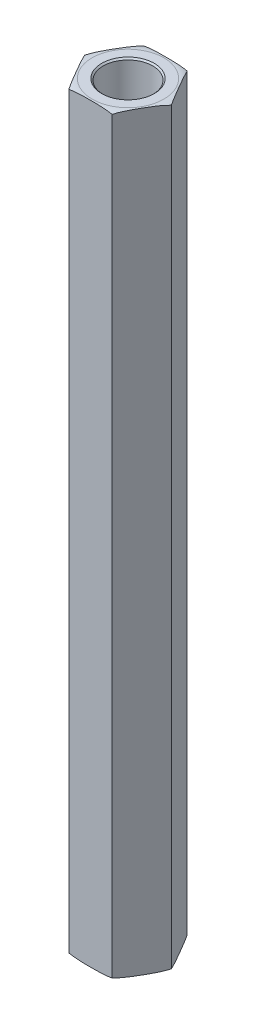
ISO-10303-21;
HEADER;
FILE_DESCRIPTION(('STEP AP214'),'2;1');
FILE_NAME('part.step','',(''),(''),'','','');
FILE_SCHEMA(('AUTOMOTIVE_DESIGN { 1 0 10303 214 1 1 1 1 }'));
ENDSEC;
DATA;
#1=APPLICATION_CONTEXT('core data for automotive mechanical design processes');
#2=APPLICATION_PROTOCOL_DEFINITION('international standard','automotive_design',2000,#1);
#3=PRODUCT_CONTEXT('',#1,'mechanical');
#4=PRODUCT('Part','Part','',(#3));
#5=PRODUCT_RELATED_PRODUCT_CATEGORY('part','',(#4));
#6=PRODUCT_DEFINITION_FORMATION('','',#4);
#7=PRODUCT_DEFINITION_CONTEXT('part definition',#1,'design');
#8=PRODUCT_DEFINITION('design','',#6,#7);
#9=PRODUCT_DEFINITION_SHAPE('','',#8);
#10=(LENGTH_UNIT() NAMED_UNIT(*) SI_UNIT(.MILLI.,.METRE.));
#11=(NAMED_UNIT(*) PLANE_ANGLE_UNIT() SI_UNIT($,.RADIAN.));
#12=(NAMED_UNIT(*) SI_UNIT($,.STERADIAN.) SOLID_ANGLE_UNIT());
#13=UNCERTAINTY_MEASURE_WITH_UNIT(LENGTH_MEASURE(1.E-05),#10,'distance_accuracy_value','');
#14=(GEOMETRIC_REPRESENTATION_CONTEXT(3) GLOBAL_UNCERTAINTY_ASSIGNED_CONTEXT((#13)) GLOBAL_UNIT_ASSIGNED_CONTEXT((#10,
#11,#12)) REPRESENTATION_CONTEXT('',''));
#15=CARTESIAN_POINT('',(0.,0.,0.));
#16=DIRECTION('',(0.,0.,1.));
#17=DIRECTION('',(1.,0.,0.));
#18=AXIS2_PLACEMENT_3D('',#15,#16,#17);
#19=CARTESIAN_POINT('',(0.,19.05,0.));
#20=DIRECTION('',(0.,1.,0.));
#21=DIRECTION('',(0.,0.,1.));
#22=AXIS2_PLACEMENT_3D('',#19,#20,#21);
#23=PLANE('',#22);
#24=CARTESIAN_POINT('',(0.,19.05,0.));
#25=DIRECTION('',(0.,1.,0.));
#26=DIRECTION('',(0.,0.,1.));
#27=AXIS2_PLACEMENT_3D('',#24,#25,#26);
#28=CIRCLE('',#27,2.0955);
#29=CARTESIAN_POINT('',(0.,19.05,2.0955));
#30=VERTEX_POINT('',#29);
#31=EDGE_CURVE('E302',#30,#30,#28,.T.);
#32=ORIENTED_EDGE('',*,*,#31,.T.);
#33=EDGE_LOOP('',(#32));
#34=FACE_BOUND('',#33,.T.);
#35=ADVANCED_FACE('F16',(#34),#23,.T.);
#36=CARTESIAN_POINT('',(0.,-19.05,0.));
#37=DIRECTION('',(0.,-1.,0.));
#38=DIRECTION('',(0.,0.,-1.));
#39=AXIS2_PLACEMENT_3D('',#36,#37,#38);
#40=PLANE('',#39);
#41=CARTESIAN_POINT('',(0.,-19.05,0.));
#42=DIRECTION('',(0.,-1.,0.));
#43=DIRECTION('',(0.,0.,-1.));
#44=AXIS2_PLACEMENT_3D('',#41,#42,#43);
#45=CIRCLE('',#44,2.0955);
#46=CARTESIAN_POINT('',(0.,-19.05,-2.0955));
#47=VERTEX_POINT('',#46);
#48=EDGE_CURVE('E312',#47,#47,#45,.T.);
#49=ORIENTED_EDGE('',*,*,#48,.T.);
#50=EDGE_LOOP('',(#49));
#51=FACE_BOUND('',#50,.T.);
#52=ADVANCED_FACE('F407',(#51),#40,.T.);
#53=CARTESIAN_POINT('',(0.,19.05,0.));
#54=DIRECTION('',(0.,1.,0.));
#55=DIRECTION('',(0.,0.,1.));
#56=AXIS2_PLACEMENT_3D('',#53,#54,#55);
#57=CYLINDRICAL_SURFACE('',#56,2.0955);
#58=CARTESIAN_POINT('',(0.,31.6230000000246,0.));
#59=DIRECTION('',(0.,1.,0.));
#60=DIRECTION('',(0.,0.,1.));
#61=AXIS2_PLACEMENT_3D('',#58,#59,#60);
#62=CIRCLE('',#61,2.09549999993897);
#63=CARTESIAN_POINT('',(0.,31.6230000000246,2.09549999993897));
#64=VERTEX_POINT('',#63);
#65=EDGE_CURVE('E314',#64,#64,#62,.T.);
#66=ORIENTED_EDGE('',*,*,#65,.T.);
#67=EDGE_LOOP('',(#66));
#68=FACE_BOUND('',#67,.T.);
#69=ORIENTED_EDGE('',*,*,#31,.F.);
#70=EDGE_LOOP('',(#69));
#71=FACE_BOUND('',#70,.T.);
#72=ADVANCED_FACE('F324',(#68,#71),#57,.F.);
#73=CARTESIAN_POINT('',(0.,-19.05,0.));
#74=DIRECTION('',(0.,-1.,0.));
#75=DIRECTION('',(0.,0.,-1.));
#76=AXIS2_PLACEMENT_3D('',#73,#74,#75);
#77=CYLINDRICAL_SURFACE('',#76,2.0955);
#78=ORIENTED_EDGE('',*,*,#48,.F.);
#79=EDGE_LOOP('',(#78));
#80=FACE_BOUND('',#79,.T.);
#81=CARTESIAN_POINT('',(0.,-31.6229999999678,0.));
#82=DIRECTION('',(0.,-1.,0.));
#83=DIRECTION('',(0.,0.,-1.));
#84=AXIS2_PLACEMENT_3D('',#81,#82,#83);
#85=CIRCLE('',#84,2.09549999999581);
#86=CARTESIAN_POINT('',(0.,-31.6229999999678,-2.09549999999581));
#87=VERTEX_POINT('',#86);
#88=EDGE_CURVE('E154',#87,#87,#85,.T.);
#89=ORIENTED_EDGE('',*,*,#88,.T.);
#90=EDGE_LOOP('',(#89));
#91=FACE_BOUND('',#90,.T.);
#92=ADVANCED_FACE('F329',(#80,#91),#77,.F.);
#93=CARTESIAN_POINT('',(0.,31.7499999999313,0.));
#94=DIRECTION('',(0.,1.,0.));
#95=DIRECTION('',(0.,0.,1.));
#96=AXIS2_PLACEMENT_3D('',#93,#94,#95);
#97=CONICAL_SURFACE('',#96,2.2224999998457,0.785398163173655);
#98=CARTESIAN_POINT('',(0.,31.7499999999882,0.));
#99=DIRECTION('',(0.,1.,0.));
#100=DIRECTION('',(0.,0.,1.));
#101=AXIS2_PLACEMENT_3D('',#98,#99,#100);
#102=CIRCLE('',#101,2.22249999990254);
#103=CARTESIAN_POINT('',(0.,31.7499999999882,2.22249999990254));
#104=VERTEX_POINT('',#103);
#105=EDGE_CURVE('E79',#104,#104,#102,.T.);
#106=ORIENTED_EDGE('',*,*,#105,.T.);
#107=EDGE_LOOP('',(#106));
#108=FACE_BOUND('',#107,.T.);
#109=ORIENTED_EDGE('',*,*,#65,.F.);
#110=EDGE_LOOP('',(#109));
#111=FACE_BOUND('',#110,.T.);
#112=ADVANCED_FACE('F327',(#108,#111),#97,.F.);
#113=CARTESIAN_POINT('',(-3.66617420935413,31.75,0.));
#114=DIRECTION('',(0.866025403784439,0.,-0.499999999999999));
#115=DIRECTION('',(-0.499999999999999,0.,-0.866025403784439));
#116=AXIS2_PLACEMENT_3D('',#113,#114,#115);
#117=PLANE('',#116);
#118=DIRECTION('',(0.,1.,0.));
#119=VECTOR('',#118,1.);
#120=CARTESIAN_POINT('',(-1.83308710467708,31.75,3.175));
#121=LINE('',#120,#119);
#122=CARTESIAN_POINT('',(-1.83308710467708,-31.623,3.17499999999999));
#123=VERTEX_POINT('',#122);
#124=CARTESIAN_POINT('',(-1.83308710467706,31.623,3.175));
#125=VERTEX_POINT('',#124);
#126=EDGE_CURVE('E75',#123,#125,#121,.T.);
#127=ORIENTED_EDGE('',*,*,#126,.T.);
#128=CARTESIAN_POINT('',(-3.66617420935412,31.623,0.));
#129=CARTESIAN_POINT('',(-3.62797961467395,31.6389014148997,0.0661549785605663));
#130=CARTESIAN_POINT('',(-3.58956810864157,31.6524886076105,0.132685658603884));
#131=CARTESIAN_POINT('',(-3.51249051795711,31.6758161979402,0.266187961794369));
#132=CARTESIAN_POINT('',(-3.47382473049846,31.6855604771397,0.333159070187402));
#133=CARTESIAN_POINT('',(-3.39641631867873,31.7019966530451,0.467234372392395));
#134=CARTESIAN_POINT('',(-3.35767399633312,31.7086945328669,0.534338043098199));
#135=CARTESIAN_POINT('',(-3.28009834620113,31.7197767572932,0.668703010556999));
#136=CARTESIAN_POINT('',(-3.24126499587771,31.724160450474,0.735964346345286));
#137=CARTESIAN_POINT('',(-3.16354065964314,31.7312403004263,0.870586845688118));
#138=CARTESIAN_POINT('',(-3.12464965374475,31.7339355237591,0.93794804386159));
#139=CARTESIAN_POINT('',(-3.04685144594592,31.7381531983713,1.07269849250697));
#140=CARTESIAN_POINT('',(-3.00794424351969,31.7396756080272,1.14008774388958));
#141=CARTESIAN_POINT('',(-2.93051517598872,31.741922705889,1.27419882283589));
#142=CARTESIAN_POINT('',(-2.89199336248934,31.7426552468181,1.34092056101652));
#143=CARTESIAN_POINT('',(-2.81494778346143,31.7435767302574,1.47436741839142));
#144=CARTESIAN_POINT('',(-2.77642401791438,31.7437656658949,1.54109253761777));
#145=CARTESIAN_POINT('',(-2.69935964431011,31.7436659966806,1.67457194815384));
#146=CARTESIAN_POINT('',(-2.6608190363182,31.7433771811766,1.74132623935042));
#147=CARTESIAN_POINT('',(-2.58373908085328,31.742221986219,1.87483263846081));
#148=CARTESIAN_POINT('',(-2.54519973341244,31.7413555970386,1.9415847463189));
#149=CARTESIAN_POINT('',(-2.46812969629769,31.7387861940656,2.07507396634286));
#150=CARTESIAN_POINT('',(-2.42959900625964,31.7370832271616,2.14181107913946));
#151=CARTESIAN_POINT('',(-2.35255651340907,31.7324387229726,2.27525259109841));
#152=CARTESIAN_POINT('',(-2.31404470975441,31.7294972471358,2.34195699171939));
#153=CARTESIAN_POINT('',(-2.25084206239943,31.7232174124749,2.45142718811108));
#154=CARTESIAN_POINT('',(-2.22613849337009,31.7203980110463,2.49421502479819));
#155=CARTESIAN_POINT('',(-2.17676945272227,31.7138696794304,2.57972471152114));
#156=CARTESIAN_POINT('',(-2.15210397034182,31.7101610809139,2.62244658019726));
#157=CARTESIAN_POINT('',(-2.10282753811695,31.7016802711497,2.70779586442647));
#158=CARTESIAN_POINT('',(-2.07821657107528,31.6969084657008,2.75042330976604));
#159=CARTESIAN_POINT('',(-2.02900094683549,31.6860987712516,2.83566727147558));
#160=CARTESIAN_POINT('',(-2.00439646085463,31.6800577313084,2.87828349128855));
#161=CARTESIAN_POINT('',(-1.95527325900933,31.6665138354161,2.96336737271506));
#162=CARTESIAN_POINT('',(-1.93075459617614,31.659010197803,3.0058349424758));
#163=CARTESIAN_POINT('',(-1.88182157373172,31.6423203507084,3.09058942351745));
#164=CARTESIAN_POINT('',(-1.8574074405327,31.6331314978033,3.1328759426409));
#165=CARTESIAN_POINT('',(-1.83308710467707,31.623,3.175));
#166=B_SPLINE_CURVE_WITH_KNOTS('',3,(#128,#129,#130,#131,#132,#133,#134,#135,#136,#137,#138,
#139,#140,#141,#142,#143,#144,#145,#146,#147,#148,#149,#150,#151,#152,#153,#154,#155,#156,#157,
#158,#159,#160,#161,#162,#163,#164,#165),.UNSPECIFIED.,.F.,.F.,(4,2,2,2,2,2,2,2,2,2,2,2,2,2,2,2,
2,2,4),(0.,0.233977307817944,0.467717675040698,0.700996973557508,0.93434190322976,
1.16781571967241,1.40129782179826,1.63243665809671,1.86357841666619,2.09482211846296,
2.32606971471497,2.557304351474,2.78852751694416,2.93698369265089,3.08538458004475,
3.23372892334585,3.38244598546613,3.53124274626084,3.68027493713584),.UNSPECIFIED.);
#167=CARTESIAN_POINT('',(-3.66617420935412,31.623,0.));
#168=VERTEX_POINT('',#167);
#169=EDGE_CURVE('E68',#168,#125,#166,.T.);
#170=ORIENTED_EDGE('',*,*,#169,.F.);
#171=DIRECTION('',(0.,1.,0.));
#172=VECTOR('',#171,1.);
#173=CARTESIAN_POINT('',(-3.66617420935413,31.75,0.));
#174=LINE('',#173,#172);
#175=CARTESIAN_POINT('',(-3.66617420935412,-31.623,0.));
#176=VERTEX_POINT('',#175);
#177=EDGE_CURVE('E72',#168,#176,#174,.F.);
#178=ORIENTED_EDGE('',*,*,#177,.T.);
#179=CARTESIAN_POINT('',(-1.83308710467708,-31.623,3.17499999999999));
#180=CARTESIAN_POINT('',(-1.87128169935725,-31.6389014148997,3.10884502143943));
#181=CARTESIAN_POINT('',(-1.90969320538963,-31.6524886076105,3.04231434139611));
#182=CARTESIAN_POINT('',(-1.98677079607409,-31.6758161979402,2.90881203820563));
#183=CARTESIAN_POINT('',(-2.02543658353273,-31.6855604771397,2.84184092981259));
#184=CARTESIAN_POINT('',(-2.10284499535247,-31.7019966530451,2.7077656276076));
#185=CARTESIAN_POINT('',(-2.14158731769807,-31.7086945328669,2.6406619569018));
#186=CARTESIAN_POINT('',(-2.21916296783006,-31.7197767572932,2.506296989443));
#187=CARTESIAN_POINT('',(-2.25799631815349,-31.724160450474,2.43903565365471));
#188=CARTESIAN_POINT('',(-2.33572065438805,-31.7312403004263,2.30441315431188));
#189=CARTESIAN_POINT('',(-2.37461166028644,-31.7339355237591,2.23705195613841));
#190=CARTESIAN_POINT('',(-2.45240986808527,-31.7381531983713,2.10230150749303));
#191=CARTESIAN_POINT('',(-2.49131707051151,-31.7396756080272,2.03491225611042));
#192=CARTESIAN_POINT('',(-2.56874613804247,-31.741922705889,1.90080117716411));
#193=CARTESIAN_POINT('',(-2.60726795154186,-31.7426552468181,1.83407943898348));
#194=CARTESIAN_POINT('',(-2.68431353056977,-31.7435767302574,1.70063258160857));
#195=CARTESIAN_POINT('',(-2.72283729611681,-31.7437656658949,1.63390746238222));
#196=CARTESIAN_POINT('',(-2.79990166972108,-31.7436659966806,1.50042805184616));
#197=CARTESIAN_POINT('',(-2.83844227771299,-31.7433771811766,1.43367376064957));
#198=CARTESIAN_POINT('',(-2.91552223317791,-31.742221986219,1.30016736153919));
#199=CARTESIAN_POINT('',(-2.95406158061876,-31.7413555970386,1.2334152536811));
#200=CARTESIAN_POINT('',(-3.0311316177335,-31.7387861940656,1.09992603365714));
#201=CARTESIAN_POINT('',(-3.06966230777156,-31.7370832271617,1.03318892086053));
#202=CARTESIAN_POINT('',(-3.14670480062212,-31.7324387229726,0.899747408901591));
#203=CARTESIAN_POINT('',(-3.18521660427678,-31.7294972471358,0.833043008280606));
#204=CARTESIAN_POINT('',(-3.24841925163176,-31.7232174124749,0.723572811888923));
#205=CARTESIAN_POINT('',(-3.27312282066111,-31.7203980110463,0.68078497520181));
#206=CARTESIAN_POINT('',(-3.32249186130892,-31.7138696794304,0.595275288478855));
#207=CARTESIAN_POINT('',(-3.34715734368937,-31.7101610809139,0.552553419802734));
#208=CARTESIAN_POINT('',(-3.39643377591424,-31.7016802711497,0.46720413557353));
#209=CARTESIAN_POINT('',(-3.42104474295591,-31.6969084657008,0.424576690233957));
#210=CARTESIAN_POINT('',(-3.4702603671957,-31.6860987712516,0.339332728524421));
#211=CARTESIAN_POINT('',(-3.49486485317656,-31.6800577313084,0.296716508711453));
#212=CARTESIAN_POINT('',(-3.54398805502186,-31.6665138354161,0.211632627284938));
#213=CARTESIAN_POINT('',(-3.56850671785505,-31.659010197803,0.169165057524199));
#214=CARTESIAN_POINT('',(-3.61743974029947,-31.6423203507084,0.0844105764825454));
#215=CARTESIAN_POINT('',(-3.64185387349849,-31.6331314978033,0.0421240573590993));
#216=CARTESIAN_POINT('',(-3.66617420935412,-31.623,0.));
#217=B_SPLINE_CURVE_WITH_KNOTS('',3,(#179,#180,#181,#182,#183,#184,#185,#186,#187,#188,#189,
#190,#191,#192,#193,#194,#195,#196,#197,#198,#199,#200,#201,#202,#203,#204,#205,#206,#207,#208,
#209,#210,#211,#212,#213,#214,#215,#216),.UNSPECIFIED.,.F.,.F.,(4,2,2,2,2,2,2,2,2,2,2,2,2,2,2,2,
2,2,4),(0.,0.233977307817944,0.467717675040698,0.700996973557507,0.934341903229758,
1.16781571967241,1.40129782179826,1.63243665809671,1.86357841666619,2.09482211846296,
2.32606971471497,2.557304351474,2.78852751694415,2.93698369265089,3.08538458004475,
3.23372892334585,3.38244598546612,3.53124274626083,3.68027493713583),.UNSPECIFIED.);
#218=EDGE_CURVE('E87',#123,#176,#217,.T.);
#219=ORIENTED_EDGE('',*,*,#218,.F.);
#220=EDGE_LOOP('',(#127,#170,#178,#219));
#221=FACE_BOUND('',#220,.T.);
#222=ADVANCED_FACE('F70',(#221),#117,.F.);
#223=CARTESIAN_POINT('',(0.,-31.7499999998745,0.));
#224=DIRECTION('',(0.,-1.,0.));
#225=DIRECTION('',(0.,0.,-1.));
#226=AXIS2_PLACEMENT_3D('',#223,#224,#225);
#227=CONICAL_SURFACE('',#226,2.22249999990254,0.785398163397448);
#228=ORIENTED_EDGE('',*,*,#88,.F.);
#229=EDGE_LOOP('',(#228));
#230=FACE_BOUND('',#229,.T.);
#231=CARTESIAN_POINT('',(0.,-31.7499999999882,0.));
#232=DIRECTION('',(0.,-1.,0.));
#233=DIRECTION('',(0.,0.,-1.));
#234=AXIS2_PLACEMENT_3D('',#231,#232,#233);
#235=CIRCLE('',#234,2.22250000001623);
#236=CARTESIAN_POINT('',(0.,-31.7499999999882,-2.22250000001623));
#237=VERTEX_POINT('',#236);
#238=EDGE_CURVE('E278',#237,#237,#235,.F.);
#239=ORIENTED_EDGE('',*,*,#238,.F.);
#240=EDGE_LOOP('',(#239));
#241=FACE_BOUND('',#240,.T.);
#242=ADVANCED_FACE('F336',(#230,#241),#227,.F.);
#243=CARTESIAN_POINT('',(-1.83308710467707,31.75,-3.175));
#244=DIRECTION('',(0.,-1.,0.));
#245=DIRECTION('',(0.,0.,-1.));
#246=AXIS2_PLACEMENT_3D('',#243,#244,#245);
#247=PLANE('',#246);
#248=CARTESIAN_POINT('',(0.,31.75,0.));
#249=DIRECTION('',(0.,-1.,0.));
#250=DIRECTION('',(0.,0.,1.));
#251=AXIS2_PLACEMENT_3D('',#248,#249,#250);
#252=CIRCLE('',#251,3.03117420935412);
#253=CARTESIAN_POINT('',(0.,31.75,3.03117420935412));
#254=VERTEX_POINT('',#253);
#255=CARTESIAN_POINT('',(0.,31.75,-3.03117420935412));
#256=VERTEX_POINT('',#255);
#257=EDGE_CURVE('E78',#254,#256,#252,.T.);
#258=ORIENTED_EDGE('',*,*,#257,.F.);
#259=CARTESIAN_POINT('',(0.,31.75,0.));
#260=DIRECTION('',(0.,-1.,0.));
#261=DIRECTION('',(0.,0.,-1.));
#262=AXIS2_PLACEMENT_3D('',#259,#260,#261);
#263=CIRCLE('',#262,3.03117420935412);
#264=EDGE_CURVE('E139',#256,#254,#263,.T.);
#265=ORIENTED_EDGE('',*,*,#264,.F.);
#266=EDGE_LOOP('',(#258,#265));
#267=FACE_BOUND('',#266,.T.);
#268=ORIENTED_EDGE('',*,*,#105,.F.);
#269=EDGE_LOOP('',(#268));
#270=FACE_BOUND('',#269,.T.);
#271=ADVANCED_FACE('F115',(#267,#270),#247,.F.);
#272=CARTESIAN_POINT('',(-1.83308710467707,31.75,-3.175));
#273=DIRECTION('',(0.866025403784439,0.,0.5));
#274=DIRECTION('',(0.5,0.,-0.866025403784439));
#275=AXIS2_PLACEMENT_3D('',#272,#273,#274);
#276=PLANE('',#275);
#277=ORIENTED_EDGE('',*,*,#177,.F.);
#278=CARTESIAN_POINT('',(-1.83308710467706,31.623,-3.17500000000001));
#279=CARTESIAN_POINT('',(-1.87128169935723,31.6389014148997,-3.10884502143945));
#280=CARTESIAN_POINT('',(-1.90969320538961,31.6524886076105,-3.04231434139614));
#281=CARTESIAN_POINT('',(-1.98677079607407,31.6758161979402,-2.90881203820566));
#282=CARTESIAN_POINT('',(-2.02543658353271,31.6855604771397,-2.84184092981263));
#283=CARTESIAN_POINT('',(-2.10284499535244,31.7019966530451,-2.70776562760764));
#284=CARTESIAN_POINT('',(-2.14158731769805,31.7086945328669,-2.64066195690184));
#285=CARTESIAN_POINT('',(-2.21916296783004,31.7197767572932,-2.50629698944304));
#286=CARTESIAN_POINT('',(-2.25799631815346,31.7241604504739,-2.43903565365476));
#287=CARTESIAN_POINT('',(-2.33572065438802,31.7312403004263,-2.30441315431193));
#288=CARTESIAN_POINT('',(-2.37461166028641,31.7339355237591,-2.23705195613846));
#289=CARTESIAN_POINT('',(-2.45240986808524,31.7381531983713,-2.10230150749309));
#290=CARTESIAN_POINT('',(-2.49131707051148,31.7396756080272,-2.03491225611048));
#291=CARTESIAN_POINT('',(-2.56874613804244,31.741922705889,-1.90080117716417));
#292=CARTESIAN_POINT('',(-2.60726795154182,31.7426552468181,-1.83407943898354));
#293=CARTESIAN_POINT('',(-2.68431353056973,31.7435767302574,-1.70063258160864));
#294=CARTESIAN_POINT('',(-2.72283729611677,31.7437656658949,-1.6339074623823));
#295=CARTESIAN_POINT('',(-2.79990166972104,31.7436659966806,-1.50042805184624));
#296=CARTESIAN_POINT('',(-2.83844227771295,31.7433771811766,-1.43367376064965));
#297=CARTESIAN_POINT('',(-2.91552223317786,31.742221986219,-1.30016736153927));
#298=CARTESIAN_POINT('',(-2.95406158061871,31.7413555970386,-1.23341525368118));
#299=CARTESIAN_POINT('',(-3.03113161773345,31.7387861940656,-1.09992603365722));
#300=CARTESIAN_POINT('',(-3.06966230777151,31.7370832271617,-1.03318892086062));
#301=CARTESIAN_POINT('',(-3.14670480062207,31.7324387229726,-0.899747408901685));
#302=CARTESIAN_POINT('',(-3.18521660427673,31.7294972471358,-0.833043008280701));
#303=CARTESIAN_POINT('',(-3.24841925163171,31.7232174124749,-0.723572811889015));
#304=CARTESIAN_POINT('',(-3.27312282066106,31.7203980110463,-0.680784975201897));
#305=CARTESIAN_POINT('',(-3.32249186130888,31.7138696794304,-0.595275288478931));
#306=CARTESIAN_POINT('',(-3.34715734368933,31.7101610809139,-0.552553419802804));
#307=CARTESIAN_POINT('',(-3.39643377591421,31.7016802711497,-0.467204135573589));
#308=CARTESIAN_POINT('',(-3.42104474295588,31.6969084657008,-0.424576690234012));
#309=CARTESIAN_POINT('',(-3.47026036719568,31.6860987712516,-0.339332728524465));
#310=CARTESIAN_POINT('',(-3.49486485317654,31.6800577313084,-0.296716508711491));
#311=CARTESIAN_POINT('',(-3.54398805502185,31.6665138354161,-0.211632627284964));
#312=CARTESIAN_POINT('',(-3.56850671785504,31.659010197803,-0.169165057524221));
#313=CARTESIAN_POINT('',(-3.61743974029947,31.6423203507084,-0.0844105764825552));
#314=CARTESIAN_POINT('',(-3.64185387349849,31.6331314978033,-0.0421240573591034));
#315=CARTESIAN_POINT('',(-3.66617420935413,31.623,0.));
#316=B_SPLINE_CURVE_WITH_KNOTS('',3,(#278,#279,#280,#281,#282,#283,#284,#285,#286,#287,#288,
#289,#290,#291,#292,#293,#294,#295,#296,#297,#298,#299,#300,#301,#302,#303,#304,#305,#306,#307,
#308,#309,#310,#311,#312,#313,#314,#315),.UNSPECIFIED.,.F.,.F.,(4,2,2,2,2,2,2,2,2,2,2,2,2,2,2,2,
2,2,4),(0.,0.233977307817937,0.467717675040683,0.700996973557484,0.934341903229729,
1.16781571967237,1.40129782179821,1.63243665809666,1.86357841666613,2.0948221184629,
2.3260697147149,2.55730435147392,2.78852751694407,2.93698369265082,3.0853845800447,
3.23372892334582,3.38244598546612,3.53124274626084,3.68027493713587),.UNSPECIFIED.);
#317=CARTESIAN_POINT('',(-1.83308710467705,31.623,-3.17500000000001));
#318=VERTEX_POINT('',#317);
#319=EDGE_CURVE('E84',#318,#168,#316,.T.);
#320=ORIENTED_EDGE('',*,*,#319,.F.);
#321=DIRECTION('',(0.,1.,0.));
#322=VECTOR('',#321,1.);
#323=CARTESIAN_POINT('',(-1.83308710467704,31.75,-3.175));
#324=LINE('',#323,#322);
#325=CARTESIAN_POINT('',(-1.83308710467708,-31.623,-3.175));
#326=VERTEX_POINT('',#325);
#327=EDGE_CURVE('E177',#318,#326,#324,.F.);
#328=ORIENTED_EDGE('',*,*,#327,.T.);
#329=CARTESIAN_POINT('',(-3.66617420935412,-31.623,0.));
#330=CARTESIAN_POINT('',(-3.62797961467395,-31.6389014148997,-0.0661549785605667));
#331=CARTESIAN_POINT('',(-3.58956810864157,-31.6524886076105,-0.132685658603884));
#332=CARTESIAN_POINT('',(-3.51249051795711,-31.6758161979402,-0.266187961794367));
#333=CARTESIAN_POINT('',(-3.47382473049847,-31.6855604771397,-0.333159070187399));
#334=CARTESIAN_POINT('',(-3.39641631867874,-31.7019966530451,-0.467234372392391));
#335=CARTESIAN_POINT('',(-3.35767399633313,-31.7086945328669,-0.534338043098195));
#336=CARTESIAN_POINT('',(-3.28009834620114,-31.7197767572932,-0.668703010556993));
#337=CARTESIAN_POINT('',(-3.24126499587771,-31.724160450474,-0.73596434634528));
#338=CARTESIAN_POINT('',(-3.16354065964315,-31.7312403004263,-0.870586845688111));
#339=CARTESIAN_POINT('',(-3.12464965374476,-31.7339355237591,-0.937948043861582));
#340=CARTESIAN_POINT('',(-3.04685144594593,-31.7381531983713,-1.07269849250696));
#341=CARTESIAN_POINT('',(-3.00794424351969,-31.7396756080272,-1.14008774388957));
#342=CARTESIAN_POINT('',(-2.93051517598873,-31.741922705889,-1.27419882283587));
#343=CARTESIAN_POINT('',(-2.89199336248934,-31.7426552468181,-1.34092056101651));
#344=CARTESIAN_POINT('',(-2.81494778346144,-31.7435767302574,-1.47436741839141));
#345=CARTESIAN_POINT('',(-2.77642401791439,-31.7437656658949,-1.54109253761776));
#346=CARTESIAN_POINT('',(-2.69935964431012,-31.7436659966806,-1.67457194815382));
#347=CARTESIAN_POINT('',(-2.66081903631821,-31.7433771811766,-1.74132623935041));
#348=CARTESIAN_POINT('',(-2.5837390808533,-31.742221986219,-1.87483263846079));
#349=CARTESIAN_POINT('',(-2.54519973341245,-31.7413555970386,-1.94158474631888));
#350=CARTESIAN_POINT('',(-2.4681296962977,-31.7387861940656,-2.07507396634284));
#351=CARTESIAN_POINT('',(-2.42959900625965,-31.7370832271617,-2.14181107913944));
#352=CARTESIAN_POINT('',(-2.35255651340908,-31.7324387229726,-2.27525259109839));
#353=CARTESIAN_POINT('',(-2.31404470975442,-31.7294972471358,-2.34195699171937));
#354=CARTESIAN_POINT('',(-2.25084206239944,-31.7232174124749,-2.45142718811105));
#355=CARTESIAN_POINT('',(-2.2261384933701,-31.7203980110463,-2.49421502479817));
#356=CARTESIAN_POINT('',(-2.17676945272228,-31.7138696794304,-2.57972471152112));
#357=CARTESIAN_POINT('',(-2.15210397034184,-31.7101610809139,-2.62244658019725));
#358=CARTESIAN_POINT('',(-2.10282753811696,-31.7016802711497,-2.70779586442645));
#359=CARTESIAN_POINT('',(-2.07821657107529,-31.6969084657008,-2.75042330976602));
#360=CARTESIAN_POINT('',(-2.0290009468355,-31.6860987712516,-2.83566727147556));
#361=CARTESIAN_POINT('',(-2.00439646085464,-31.6800577313084,-2.87828349128853));
#362=CARTESIAN_POINT('',(-1.95527325900934,-31.6665138354161,-2.96336737271505));
#363=CARTESIAN_POINT('',(-1.93075459617615,-31.659010197803,-3.00583494247579));
#364=CARTESIAN_POINT('',(-1.88182157373172,-31.6423203507084,-3.09058942351744));
#365=CARTESIAN_POINT('',(-1.85740744053271,-31.6331314978033,-3.13287594264089));
#366=CARTESIAN_POINT('',(-1.83308710467707,-31.623,-3.17499999999999));
#367=B_SPLINE_CURVE_WITH_KNOTS('',3,(#329,#330,#331,#332,#333,#334,#335,#336,#337,#338,#339,
#340,#341,#342,#343,#344,#345,#346,#347,#348,#349,#350,#351,#352,#353,#354,#355,#356,#357,#358,
#359,#360,#361,#362,#363,#364,#365,#366),.UNSPECIFIED.,.F.,.F.,(4,2,2,2,2,2,2,2,2,2,2,2,2,2,2,2,
2,2,4),(0.,0.233977307817942,0.467717675040695,0.700996973557501,0.934341903229752,
1.1678157196724,1.40129782179825,1.6324366580967,1.86357841666617,2.09482211846295,
2.32606971471495,2.55730435147398,2.78852751694413,2.93698369265087,3.08538458004473,
3.23372892334584,3.38244598546612,3.53124274626082,3.68027493713583),.UNSPECIFIED.);
#368=EDGE_CURVE('E86',#176,#326,#367,.T.);
#369=ORIENTED_EDGE('',*,*,#368,.F.);
#370=EDGE_LOOP('',(#277,#320,#328,#369));
#371=FACE_BOUND('',#370,.T.);
#372=ADVANCED_FACE('F82',(#371),#276,.F.);
#373=CARTESIAN_POINT('',(-1.83308710467707,31.75,3.175));
#374=DIRECTION('',(0.,0.,-1.));
#375=DIRECTION('',(-1.,0.,0.));
#376=AXIS2_PLACEMENT_3D('',#373,#374,#375);
#377=PLANE('',#376);
#378=DIRECTION('',(0.,1.,0.));
#379=VECTOR('',#378,1.);
#380=CARTESIAN_POINT('',(1.83308710467706,31.75,3.17499999999999));
#381=LINE('',#380,#379);
#382=CARTESIAN_POINT('',(1.83308710467706,-31.623,3.17499999999999));
#383=VERTEX_POINT('',#382);
#384=CARTESIAN_POINT('',(1.83308710467706,31.623,3.17499999999999));
#385=VERTEX_POINT('',#384);
#386=EDGE_CURVE('E179',#383,#385,#381,.T.);
#387=ORIENTED_EDGE('',*,*,#386,.T.);
#388=CARTESIAN_POINT('',(-1.83308710467706,31.623,3.175));
#389=CARTESIAN_POINT('',(-1.73237579828683,31.6439400141518,3.175));
#390=CARTESIAN_POINT('',(-1.63096506893486,31.6608853495327,3.175));
#391=CARTESIAN_POINT('',(-1.42767146651469,31.6884971643984,3.175));
#392=CARTESIAN_POINT('',(-1.32579191427254,31.6991875658753,3.175));
#393=CARTESIAN_POINT('',(-1.12177634709138,31.7161280408079,3.175));
#394=CARTESIAN_POINT('',(-1.0196405664338,31.7223812707189,3.175));
#395=CARTESIAN_POINT('',(-0.815663681397377,31.7319028064183,3.175));
#396=CARTESIAN_POINT('',(-0.713823115514574,31.7351834044999,3.175));
#397=CARTESIAN_POINT('',(-0.510018485441651,31.7399454848703,3.175));
#398=CARTESIAN_POINT('',(-0.408054390577977,31.7414254100882,3.175));
#399=CARTESIAN_POINT('',(-0.204060200337871,31.7433146818379,3.175));
#400=CARTESIAN_POINT('',(-0.102030100168935,31.7437234241492,3.17499999999999));
#401=CARTESIAN_POINT('',(0.102030100168936,31.7437234241492,3.17499999999999));
#402=CARTESIAN_POINT('',(0.204060200337871,31.7433146818379,3.17499999999999));
#403=CARTESIAN_POINT('',(0.408054390577978,31.7414254100882,3.175));
#404=CARTESIAN_POINT('',(0.510018485441653,31.7399454848703,3.17499999999999));
#405=CARTESIAN_POINT('',(0.713823115514575,31.7351834044999,3.17499999999999));
#406=CARTESIAN_POINT('',(0.815663681397378,31.7319028064183,3.17499999999999));
#407=CARTESIAN_POINT('',(1.0196405664338,31.7223812707189,3.17499999999999));
#408=CARTESIAN_POINT('',(1.12177634709138,31.7161280408079,3.17499999999999));
#409=CARTESIAN_POINT('',(1.32579191427254,31.6991875658753,3.17499999999999));
#410=CARTESIAN_POINT('',(1.42767146651469,31.6884971643984,3.17499999999999));
#411=CARTESIAN_POINT('',(1.63096506893486,31.6608853495327,3.17499999999999));
#412=CARTESIAN_POINT('',(1.73237579828684,31.6439400141518,3.17499999999999));
#413=CARTESIAN_POINT('',(1.83308710467706,31.623,3.17499999999999));
#414=B_SPLINE_CURVE_WITH_KNOTS('',3,(#388,#389,#390,#391,#392,#393,#394,#395,#396,#397,#398,
#399,#400,#401,#402,#403,#404,#405,#406,#407,#408,#409,#410,#411,#412,#413),.UNSPECIFIED.,.F.,
.F.,(4,2,2,2,2,2,2,2,2,2,2,2,4),(0.,0.308333242342808,0.615479423308236,0.92240689113001,
1.2280592962085,1.53397581645216,1.84006485747889,2.14615389850562,2.45207041874928,
2.75772282382777,3.06465029164955,3.37179647261497,3.68012971495778),.UNSPECIFIED.);
#415=EDGE_CURVE('E273',#125,#385,#414,.T.);
#416=ORIENTED_EDGE('',*,*,#415,.F.);
#417=ORIENTED_EDGE('',*,*,#126,.F.);
#418=CARTESIAN_POINT('',(1.83308710467706,-31.623,3.17499999999999));
#419=CARTESIAN_POINT('',(1.73237579828684,-31.6439400141518,3.17499999999999));
#420=CARTESIAN_POINT('',(1.63096506893486,-31.6608853495327,3.17499999999999));
#421=CARTESIAN_POINT('',(1.42767146651469,-31.6884971643984,3.17499999999999));
#422=CARTESIAN_POINT('',(1.32579191427254,-31.6991875658753,3.17499999999999));
#423=CARTESIAN_POINT('',(1.12177634709138,-31.7161280408079,3.17499999999999));
#424=CARTESIAN_POINT('',(1.0196405664338,-31.7223812707189,3.17499999999999));
#425=CARTESIAN_POINT('',(0.815663681397379,-31.7319028064183,3.17499999999999));
#426=CARTESIAN_POINT('',(0.713823115514576,-31.7351834044999,3.17499999999999));
#427=CARTESIAN_POINT('',(0.510018485441653,-31.7399454848703,3.17499999999999));
#428=CARTESIAN_POINT('',(0.408054390577978,-31.7414254100882,3.175));
#429=CARTESIAN_POINT('',(0.204060200337871,-31.7433146818379,3.17499999999999));
#430=CARTESIAN_POINT('',(0.102030100168936,-31.7437234241492,3.17499999999999));
#431=CARTESIAN_POINT('',(-0.102030100168936,-31.7437234241492,3.17499999999999));
#432=CARTESIAN_POINT('',(-0.204060200337873,-31.7433146818379,3.175));
#433=CARTESIAN_POINT('',(-0.408054390577981,-31.7414254100882,3.175));
#434=CARTESIAN_POINT('',(-0.510018485441656,-31.7399454848703,3.175));
#435=CARTESIAN_POINT('',(-0.71382311551458,-31.7351834044999,3.175));
#436=CARTESIAN_POINT('',(-0.815663681397384,-31.7319028064183,3.175));
#437=CARTESIAN_POINT('',(-1.01964056643381,-31.7223812707189,3.175));
#438=CARTESIAN_POINT('',(-1.12177634709139,-31.7161280408079,3.175));
#439=CARTESIAN_POINT('',(-1.32579191427255,-31.6991875658753,3.175));
#440=CARTESIAN_POINT('',(-1.4276714665147,-31.6884971643984,3.175));
#441=CARTESIAN_POINT('',(-1.63096506893487,-31.6608853495327,3.175));
#442=CARTESIAN_POINT('',(-1.73237579828685,-31.6439400141518,3.175));
#443=CARTESIAN_POINT('',(-1.83308710467708,-31.623,3.175));
#444=B_SPLINE_CURVE_WITH_KNOTS('',3,(#418,#419,#420,#421,#422,#423,#424,#425,#426,#427,#428,
#429,#430,#431,#432,#433,#434,#435,#436,#437,#438,#439,#440,#441,#442,#443),.UNSPECIFIED.,.F.,
.F.,(4,2,2,2,2,2,2,2,2,2,2,2,4),(0.,0.308333242342809,0.615479423308237,0.922406891130012,
1.2280592962085,1.53397581645216,1.84006485747889,2.14615389850562,2.45207041874929,
2.75772282382778,3.06465029164956,3.37179647261499,3.6801297149578),.UNSPECIFIED.);
#445=EDGE_CURVE('E250',#383,#123,#444,.T.);
#446=ORIENTED_EDGE('',*,*,#445,.F.);
#447=EDGE_LOOP('',(#387,#416,#417,#446));
#448=FACE_BOUND('',#447,.T.);
#449=ADVANCED_FACE('F203',(#448),#377,.F.);
#450=CARTESIAN_POINT('',(-1.83308710467707,-31.75,-3.175));
#451=DIRECTION('',(0.,-1.,0.));
#452=DIRECTION('',(0.,0.,-1.));
#453=AXIS2_PLACEMENT_3D('',#450,#451,#452);
#454=PLANE('',#453);
#455=CARTESIAN_POINT('',(0.,-31.75,0.));
#456=DIRECTION('',(0.,1.,0.));
#457=DIRECTION('',(0.,0.,1.));
#458=AXIS2_PLACEMENT_3D('',#455,#456,#457);
#459=CIRCLE('',#458,3.03117420935412);
#460=CARTESIAN_POINT('',(0.,-31.75,3.03117420935412));
#461=VERTEX_POINT('',#460);
#462=CARTESIAN_POINT('',(0.,-31.75,-3.03117420935412));
#463=VERTEX_POINT('',#462);
#464=EDGE_CURVE('E189',#461,#463,#459,.T.);
#465=ORIENTED_EDGE('',*,*,#464,.F.);
#466=CARTESIAN_POINT('',(0.,-31.75,0.));
#467=DIRECTION('',(0.,1.,0.));
#468=DIRECTION('',(0.,0.,-1.));
#469=AXIS2_PLACEMENT_3D('',#466,#467,#468);
#470=CIRCLE('',#469,3.03117420935412);
#471=EDGE_CURVE('E182',#461,#463,#470,.F.);
#472=ORIENTED_EDGE('',*,*,#471,.T.);
#473=EDGE_LOOP('',(#465,#472));
#474=FACE_BOUND('',#473,.T.);
#475=ORIENTED_EDGE('',*,*,#238,.T.);
#476=EDGE_LOOP('',(#475));
#477=FACE_BOUND('',#476,.T.);
#478=ADVANCED_FACE('F194',(#474,#477),#454,.T.);
#479=CARTESIAN_POINT('',(1.83308710467706,31.75,3.17499999999999));
#480=DIRECTION('',(-0.866025403784439,0.,-0.5));
#481=DIRECTION('',(-0.5,0.,0.866025403784439));
#482=AXIS2_PLACEMENT_3D('',#479,#480,#481);
#483=PLANE('',#482);
#484=DIRECTION('',(0.,1.,0.));
#485=VECTOR('',#484,1.);
#486=CARTESIAN_POINT('',(3.66617420935412,31.75,0.));
#487=LINE('',#486,#485);
#488=CARTESIAN_POINT('',(3.66617420935412,-31.623,0.));
#489=VERTEX_POINT('',#488);
#490=CARTESIAN_POINT('',(3.66617420935412,31.623,0.));
#491=VERTEX_POINT('',#490);
#492=EDGE_CURVE('E235',#489,#491,#487,.T.);
#493=ORIENTED_EDGE('',*,*,#492,.T.);
#494=CARTESIAN_POINT('',(1.83308710467706,31.623,3.17499999999999));
#495=CARTESIAN_POINT('',(1.87128169935724,31.6389014148997,3.10884502143943));
#496=CARTESIAN_POINT('',(1.90969320538961,31.6524886076105,3.04231434139612));
#497=CARTESIAN_POINT('',(1.98677079607408,31.6758161979402,2.90881203820563));
#498=CARTESIAN_POINT('',(2.02543658353272,31.6855604771397,2.8418409298126));
#499=CARTESIAN_POINT('',(2.10284499535245,31.7019966530451,2.70776562760761));
#500=CARTESIAN_POINT('',(2.14158731769806,31.7086945328669,2.6406619569018));
#501=CARTESIAN_POINT('',(2.21916296783005,31.7197767572932,2.506296989443));
#502=CARTESIAN_POINT('',(2.25799631815348,31.724160450474,2.43903565365472));
#503=CARTESIAN_POINT('',(2.33572065438804,31.7312403004263,2.30441315431189));
#504=CARTESIAN_POINT('',(2.37461166028643,31.7339355237591,2.23705195613841));
#505=CARTESIAN_POINT('',(2.45240986808526,31.7381531983713,2.10230150749304));
#506=CARTESIAN_POINT('',(2.4913170705115,31.7396756080272,2.03491225611043));
#507=CARTESIAN_POINT('',(2.56874613804246,31.741922705889,1.90080117716412));
#508=CARTESIAN_POINT('',(2.60726795154185,31.7426552468181,1.83407943898349));
#509=CARTESIAN_POINT('',(2.68431353056976,31.7435767302574,1.70063258160858));
#510=CARTESIAN_POINT('',(2.7228372961168,31.7437656658949,1.63390746238223));
#511=CARTESIAN_POINT('',(2.79990166972107,31.7436659966806,1.50042805184617));
#512=CARTESIAN_POINT('',(2.83844227771298,31.7433771811766,1.43367376064958));
#513=CARTESIAN_POINT('',(2.9155222331779,31.742221986219,1.3001673615392));
#514=CARTESIAN_POINT('',(2.95406158061874,31.7413555970386,1.23341525368111));
#515=CARTESIAN_POINT('',(3.03113161773349,31.7387861940656,1.09992603365715));
#516=CARTESIAN_POINT('',(3.06966230777154,31.7370832271617,1.03318892086055));
#517=CARTESIAN_POINT('',(3.14670480062211,31.7324387229726,0.899747408901602));
#518=CARTESIAN_POINT('',(3.18521660427677,31.7294972471358,0.833043008280616));
#519=CARTESIAN_POINT('',(3.24841925163175,31.7232174124749,0.723572811888934));
#520=CARTESIAN_POINT('',(3.2731228206611,31.7203980110463,0.68078497520182));
#521=CARTESIAN_POINT('',(3.32249186130891,31.7138696794304,0.595275288478865));
#522=CARTESIAN_POINT('',(3.34715734368936,31.7101610809139,0.552553419802743));
#523=CARTESIAN_POINT('',(3.39643377591423,31.7016802711497,0.467204135573538));
#524=CARTESIAN_POINT('',(3.4210447429559,31.6969084657008,0.424576690233965));
#525=CARTESIAN_POINT('',(3.47026036719569,31.6860987712516,0.339332728524429));
#526=CARTESIAN_POINT('',(3.49486485317655,31.6800577313084,0.29671650871146));
#527=CARTESIAN_POINT('',(3.54398805502185,31.6665138354161,0.211632627284944));
#528=CARTESIAN_POINT('',(3.56850671785504,31.659010197803,0.169165057524205));
#529=CARTESIAN_POINT('',(3.61743974029947,31.6423203507084,0.0844105764825504));
#530=CARTESIAN_POINT('',(3.64185387349848,31.6331314978033,0.0421240573591037));
#531=CARTESIAN_POINT('',(3.66617420935412,31.623,0.));
#532=B_SPLINE_CURVE_WITH_KNOTS('',3,(#494,#495,#496,#497,#498,#499,#500,#501,#502,#503,#504,
#505,#506,#507,#508,#509,#510,#511,#512,#513,#514,#515,#516,#517,#518,#519,#520,#521,#522,#523,
#524,#525,#526,#527,#528,#529,#530,#531),.UNSPECIFIED.,.F.,.F.,(4,2,2,2,2,2,2,2,2,2,2,2,2,2,2,2,
2,2,4),(0.,0.233977307817943,0.467717675040697,0.700996973557505,0.934341903229756,
1.1678157196724,1.40129782179825,1.63243665809671,1.86357841666618,2.09482211846296,
2.32606971471496,2.55730435147399,2.78852751694415,2.93698369265089,3.08538458004475,
3.23372892334585,3.38244598546612,3.53124274626083,3.68027493713584),.UNSPECIFIED.);
#533=EDGE_CURVE('E268',#385,#491,#532,.T.);
#534=ORIENTED_EDGE('',*,*,#533,.F.);
#535=ORIENTED_EDGE('',*,*,#386,.F.);
#536=CARTESIAN_POINT('',(3.66617420935412,-31.623,0.));
#537=CARTESIAN_POINT('',(3.62797961467394,-31.6389014148997,0.0661549785605657));
#538=CARTESIAN_POINT('',(3.58956810864156,-31.6524886076105,0.132685658603883));
#539=CARTESIAN_POINT('',(3.5124905179571,-31.6758161979402,0.266187961794369));
#540=CARTESIAN_POINT('',(3.47382473049846,-31.6855604771397,0.333159070187401));
#541=CARTESIAN_POINT('',(3.39641631867873,-31.7019966530451,0.467234372392394));
#542=CARTESIAN_POINT('',(3.35767399633312,-31.7086945328669,0.534338043098198));
#543=CARTESIAN_POINT('',(3.28009834620112,-31.7197767572932,0.668703010556997));
#544=CARTESIAN_POINT('',(3.2412649958777,-31.724160450474,0.735964346345285));
#545=CARTESIAN_POINT('',(3.16354065964314,-31.7312403004263,0.870586845688117));
#546=CARTESIAN_POINT('',(3.12464965374475,-31.7339355237591,0.93794804386159));
#547=CARTESIAN_POINT('',(3.04685144594592,-31.7381531983713,1.07269849250697));
#548=CARTESIAN_POINT('',(3.00794424351968,-31.7396756080272,1.14008774388958));
#549=CARTESIAN_POINT('',(2.93051517598872,-31.741922705889,1.27419882283588));
#550=CARTESIAN_POINT('',(2.89199336248933,-31.7426552468181,1.34092056101652));
#551=CARTESIAN_POINT('',(2.81494778346142,-31.7435767302574,1.47436741839142));
#552=CARTESIAN_POINT('',(2.77642401791438,-31.7437656658949,1.54109253761777));
#553=CARTESIAN_POINT('',(2.69935964431011,-31.7436659966806,1.67457194815384));
#554=CARTESIAN_POINT('',(2.6608190363182,-31.7433771811766,1.74132623935042));
#555=CARTESIAN_POINT('',(2.58373908085328,-31.742221986219,1.87483263846081));
#556=CARTESIAN_POINT('',(2.54519973341243,-31.7413555970386,1.9415847463189));
#557=CARTESIAN_POINT('',(2.46812969629769,-31.7387861940656,2.07507396634286));
#558=CARTESIAN_POINT('',(2.42959900625963,-31.7370832271617,2.14181107913946));
#559=CARTESIAN_POINT('',(2.35255651340906,-31.7324387229726,2.27525259109841));
#560=CARTESIAN_POINT('',(2.3140447097544,-31.7294972471358,2.34195699171939));
#561=CARTESIAN_POINT('',(2.25084206239942,-31.7232174124749,2.45142718811108));
#562=CARTESIAN_POINT('',(2.22613849337008,-31.7203980110463,2.49421502479819));
#563=CARTESIAN_POINT('',(2.17676945272226,-31.7138696794304,2.57972471152114));
#564=CARTESIAN_POINT('',(2.15210397034182,-31.7101610809139,2.62244658019726));
#565=CARTESIAN_POINT('',(2.10282753811695,-31.7016802711497,2.70779586442647));
#566=CARTESIAN_POINT('',(2.07821657107528,-31.6969084657008,2.75042330976604));
#567=CARTESIAN_POINT('',(2.02900094683549,-31.6860987712516,2.83566727147557));
#568=CARTESIAN_POINT('',(2.00439646085463,-31.6800577313084,2.87828349128854));
#569=CARTESIAN_POINT('',(1.95527325900933,-31.6665138354161,2.96336737271506));
#570=CARTESIAN_POINT('',(1.93075459617614,-31.659010197803,3.00583494247579));
#571=CARTESIAN_POINT('',(1.88182157373171,-31.6423203507084,3.09058942351745));
#572=CARTESIAN_POINT('',(1.8574074405327,-31.6331314978033,3.13287594264089));
#573=CARTESIAN_POINT('',(1.83308710467706,-31.623,3.17499999999999));
#574=B_SPLINE_CURVE_WITH_KNOTS('',3,(#536,#537,#538,#539,#540,#541,#542,#543,#544,#545,#546,
#547,#548,#549,#550,#551,#552,#553,#554,#555,#556,#557,#558,#559,#560,#561,#562,#563,#564,#565,
#566,#567,#568,#569,#570,#571,#572,#573),.UNSPECIFIED.,.F.,.F.,(4,2,2,2,2,2,2,2,2,2,2,2,2,2,2,2,
2,2,4),(0.,0.233977307817944,0.467717675040699,0.700996973557508,0.93434190322976,
1.16781571967241,1.40129782179826,1.63243665809671,1.86357841666619,2.09482211846297,
2.32606971471497,2.557304351474,2.78852751694416,2.9369836926509,3.08538458004475,
3.23372892334585,3.38244598546613,3.53124274626083,3.68027493713583),.UNSPECIFIED.);
#575=EDGE_CURVE('E255',#489,#383,#574,.T.);
#576=ORIENTED_EDGE('',*,*,#575,.F.);
#577=EDGE_LOOP('',(#493,#534,#535,#576));
#578=FACE_BOUND('',#577,.T.);
#579=ADVANCED_FACE('F167',(#578),#483,.F.);
#580=CARTESIAN_POINT('',(0.,30.099,0.));
#581=DIRECTION('',(0.,1.,0.));
#582=DIRECTION('',(0.,0.,1.));
#583=AXIS2_PLACEMENT_3D('',#580,#581,#582);
#584=TOROIDAL_SURFACE('',#583,3.03117420935412,1.65099999999998);
#585=ORIENTED_EDGE('',*,*,#257,.T.);
#586=ORIENTED_EDGE('',*,*,#264,.T.);
#587=EDGE_LOOP('',(#585,#586));
#588=FACE_BOUND('',#587,.T.);
#589=ORIENTED_EDGE('',*,*,#533,.T.);
#590=CARTESIAN_POINT('',(3.66617420935412,31.623,0.));
#591=CARTESIAN_POINT('',(3.62797961467394,31.6389014148997,-0.0661549785605587));
#592=CARTESIAN_POINT('',(3.58956810864157,31.6524886076105,-0.132685658603877));
#593=CARTESIAN_POINT('',(3.5124905179571,31.6758161979402,-0.266187961794362));
#594=CARTESIAN_POINT('',(3.47382473049846,31.6855604771397,-0.333159070187394));
#595=CARTESIAN_POINT('',(3.39641631867873,31.7019966530451,-0.467234372392387));
#596=CARTESIAN_POINT('',(3.35767399633312,31.7086945328669,-0.53433804309819));
#597=CARTESIAN_POINT('',(3.28009834620113,31.7197767572932,-0.668703010556989));
#598=CARTESIAN_POINT('',(3.2412649958777,31.724160450474,-0.735964346345277));
#599=CARTESIAN_POINT('',(3.16354065964314,31.7312403004263,-0.870586845688108));
#600=CARTESIAN_POINT('',(3.12464965374475,31.7339355237591,-0.937948043861581));
#601=CARTESIAN_POINT('',(3.04685144594592,31.7381531983713,-1.07269849250696));
#602=CARTESIAN_POINT('',(3.00794424351968,31.7396756080272,-1.14008774388957));
#603=CARTESIAN_POINT('',(2.93051517598872,31.741922705889,-1.27419882283588));
#604=CARTESIAN_POINT('',(2.89199336248933,31.7426552468181,-1.34092056101651));
#605=CARTESIAN_POINT('',(2.81494778346142,31.7435767302574,-1.47436741839141));
#606=CARTESIAN_POINT('',(2.77642401791438,31.7437656658949,-1.54109253761776));
#607=CARTESIAN_POINT('',(2.69935964431011,31.7436659966806,-1.67457194815383));
#608=CARTESIAN_POINT('',(2.6608190363182,31.7433771811766,-1.74132623935041));
#609=CARTESIAN_POINT('',(2.58373908085328,31.742221986219,-1.87483263846079));
#610=CARTESIAN_POINT('',(2.54519973341244,31.7413555970386,-1.94158474631889));
#611=CARTESIAN_POINT('',(2.46812969629769,31.7387861940656,-2.07507396634285));
#612=CARTESIAN_POINT('',(2.42959900625963,31.7370832271617,-2.14181107913945));
#613=CARTESIAN_POINT('',(2.35255651340907,31.7324387229726,-2.27525259109839));
#614=CARTESIAN_POINT('',(2.31404470975441,31.7294972471358,-2.34195699171938));
#615=CARTESIAN_POINT('',(2.25084206239943,31.7232174124749,-2.45142718811106));
#616=CARTESIAN_POINT('',(2.22613849337008,31.7203980110463,-2.49421502479818));
#617=CARTESIAN_POINT('',(2.17676945272226,31.7138696794304,-2.57972471152113));
#618=CARTESIAN_POINT('',(2.15210397034182,31.7101610809139,-2.62244658019726));
#619=CARTESIAN_POINT('',(2.10282753811695,31.7016802711497,-2.70779586442646));
#620=CARTESIAN_POINT('',(2.07821657107528,31.6969084657008,-2.75042330976603));
#621=CARTESIAN_POINT('',(2.02900094683549,31.6860987712516,-2.83566727147557));
#622=CARTESIAN_POINT('',(2.00439646085462,31.6800577313084,-2.87828349128854));
#623=CARTESIAN_POINT('',(1.95527325900933,31.6665138354161,-2.96336737271506));
#624=CARTESIAN_POINT('',(1.93075459617613,31.659010197803,-3.0058349424758));
#625=CARTESIAN_POINT('',(1.88182157373171,31.6423203507084,-3.09058942351745));
#626=CARTESIAN_POINT('',(1.85740744053269,31.6331314978033,-3.1328759426409));
#627=CARTESIAN_POINT('',(1.83308710467705,31.623,-3.175));
#628=B_SPLINE_CURVE_WITH_KNOTS('',3,(#590,#591,#592,#593,#594,#595,#596,#597,#598,#599,#600,
#601,#602,#603,#604,#605,#606,#607,#608,#609,#610,#611,#612,#613,#614,#615,#616,#617,#618,#619,
#620,#621,#622,#623,#624,#625,#626,#627),.UNSPECIFIED.,.F.,.F.,(4,2,2,2,2,2,2,2,2,2,2,2,2,2,2,2,
2,2,4),(0.,0.233977307817943,0.467717675040698,0.700996973557506,0.934341903229758,
1.16781571967241,1.40129782179826,1.63243665809671,1.86357841666618,2.09482211846296,
2.32606971471497,2.557304351474,2.78852751694415,2.93698369265089,3.08538458004475,
3.23372892334586,3.38244598546614,3.53124274626085,3.68027493713585),.UNSPECIFIED.);
#629=CARTESIAN_POINT('',(1.83308710467705,31.623,-3.175));
#630=VERTEX_POINT('',#629);
#631=EDGE_CURVE('E238',#491,#630,#628,.T.);
#632=ORIENTED_EDGE('',*,*,#631,.T.);
#633=CARTESIAN_POINT('',(1.83308710467705,31.623,-3.175));
#634=CARTESIAN_POINT('',(1.73237579828683,31.6439400141518,-3.175));
#635=CARTESIAN_POINT('',(1.63096506893486,31.6608853495327,-3.175));
#636=CARTESIAN_POINT('',(1.42767146651469,31.6884971643984,-3.175));
#637=CARTESIAN_POINT('',(1.32579191427254,31.6991875658753,-3.175));
#638=CARTESIAN_POINT('',(1.12177634709137,31.7161280408079,-3.175));
#639=CARTESIAN_POINT('',(1.01964056643379,31.7223812707189,-3.175));
#640=CARTESIAN_POINT('',(0.815663681397374,31.7319028064183,-3.175));
#641=CARTESIAN_POINT('',(0.713823115514572,31.7351834044999,-3.175));
#642=CARTESIAN_POINT('',(0.51001848544165,31.7399454848703,-3.175));
#643=CARTESIAN_POINT('',(0.408054390577976,31.7414254100882,-3.175));
#644=CARTESIAN_POINT('',(0.20406020033787,31.7433146818379,-3.175));
#645=CARTESIAN_POINT('',(0.102030100168935,31.7437234241492,-3.17500000000001));
#646=CARTESIAN_POINT('',(-0.102030100168934,31.7437234241492,-3.17500000000001));
#647=CARTESIAN_POINT('',(-0.204060200337869,31.7433146818379,-3.175));
#648=CARTESIAN_POINT('',(-0.408054390577974,31.7414254100882,-3.175));
#649=CARTESIAN_POINT('',(-0.510018485441648,31.7399454848703,-3.175));
#650=CARTESIAN_POINT('',(-0.713823115514568,31.7351834044999,-3.175));
#651=CARTESIAN_POINT('',(-0.81566368139737,31.7319028064183,-3.175));
#652=CARTESIAN_POINT('',(-1.01964056643379,31.7223812707189,-3.175));
#653=CARTESIAN_POINT('',(-1.12177634709137,31.7161280408079,-3.175));
#654=CARTESIAN_POINT('',(-1.32579191427253,31.6991875658753,-3.175));
#655=CARTESIAN_POINT('',(-1.42767146651468,31.6884971643984,-3.175));
#656=CARTESIAN_POINT('',(-1.63096506893485,31.6608853495327,-3.175));
#657=CARTESIAN_POINT('',(-1.73237579828682,31.6439400141518,-3.175));
#658=CARTESIAN_POINT('',(-1.83308710467705,31.623,-3.17500000000001));
#659=B_SPLINE_CURVE_WITH_KNOTS('',3,(#633,#634,#635,#636,#637,#638,#639,#640,#641,#642,#643,
#644,#645,#646,#647,#648,#649,#650,#651,#652,#653,#654,#655,#656,#657,#658),.UNSPECIFIED.,.F.,
.F.,(4,2,2,2,2,2,2,2,2,2,2,2,4),(0.,0.308333242342807,0.615479423308234,0.922406891130008,
1.2280592962085,1.53397581645216,1.84006485747888,2.14615389850561,2.45207041874927,
2.75772282382776,3.06465029164953,3.37179647261496,3.68012971495776),.UNSPECIFIED.);
#660=EDGE_CURVE('E92',#630,#318,#659,.T.);
#661=ORIENTED_EDGE('',*,*,#660,.T.);
#662=ORIENTED_EDGE('',*,*,#319,.T.);
#663=ORIENTED_EDGE('',*,*,#169,.T.);
#664=ORIENTED_EDGE('',*,*,#415,.T.);
#665=EDGE_LOOP('',(#589,#632,#661,#662,#663,#664));
#666=FACE_BOUND('',#665,.T.);
#667=ADVANCED_FACE('F90',(#588,#666),#584,.T.);
#668=CARTESIAN_POINT('',(1.83308710467706,31.75,-3.175));
#669=DIRECTION('',(0.,0.,1.));
#670=DIRECTION('',(1.,0.,0.));
#671=AXIS2_PLACEMENT_3D('',#668,#669,#670);
#672=PLANE('',#671);
#673=ORIENTED_EDGE('',*,*,#327,.F.);
#674=ORIENTED_EDGE('',*,*,#660,.F.);
#675=DIRECTION('',(0.,1.,0.));
#676=VECTOR('',#675,1.);
#677=CARTESIAN_POINT('',(1.83308710467705,31.75,-3.175));
#678=LINE('',#677,#676);
#679=CARTESIAN_POINT('',(1.83308710467706,-31.623,-3.175));
#680=VERTEX_POINT('',#679);
#681=EDGE_CURVE('E27',#630,#680,#678,.F.);
#682=ORIENTED_EDGE('',*,*,#681,.T.);
#683=CARTESIAN_POINT('',(-1.83308710467708,-31.623,-3.17500000000001));
#684=CARTESIAN_POINT('',(-1.73237579828685,-31.6439400141518,-3.175));
#685=CARTESIAN_POINT('',(-1.63096506893487,-31.6608853495327,-3.175));
#686=CARTESIAN_POINT('',(-1.42767146651471,-31.6884971643984,-3.175));
#687=CARTESIAN_POINT('',(-1.32579191427255,-31.6991875658753,-3.175));
#688=CARTESIAN_POINT('',(-1.12177634709139,-31.7161280408079,-3.175));
#689=CARTESIAN_POINT('',(-1.01964056643381,-31.7223812707189,-3.175));
#690=CARTESIAN_POINT('',(-0.815663681397384,-31.7319028064183,-3.175));
#691=CARTESIAN_POINT('',(-0.71382311551458,-31.7351834044999,-3.175));
#692=CARTESIAN_POINT('',(-0.510018485441656,-31.7399454848703,-3.175));
#693=CARTESIAN_POINT('',(-0.408054390577981,-31.7414254100882,-3.175));
#694=CARTESIAN_POINT('',(-0.204060200337873,-31.7433146818379,-3.175));
#695=CARTESIAN_POINT('',(-0.102030100168936,-31.7437234241492,-3.17500000000001));
#696=CARTESIAN_POINT('',(0.102030100168935,-31.7437234241492,-3.17500000000001));
#697=CARTESIAN_POINT('',(0.20406020033787,-31.7433146818379,-3.175));
#698=CARTESIAN_POINT('',(0.408054390577977,-31.7414254100882,-3.175));
#699=CARTESIAN_POINT('',(0.510018485441651,-31.7399454848703,-3.175));
#700=CARTESIAN_POINT('',(0.713823115514573,-31.7351834044999,-3.175));
#701=CARTESIAN_POINT('',(0.815663681397376,-31.7319028064183,-3.175));
#702=CARTESIAN_POINT('',(1.0196405664338,-31.7223812707189,-3.175));
#703=CARTESIAN_POINT('',(1.12177634709138,-31.7161280408079,-3.175));
#704=CARTESIAN_POINT('',(1.32579191427254,-31.6991875658753,-3.175));
#705=CARTESIAN_POINT('',(1.42767146651469,-31.6884971643984,-3.175));
#706=CARTESIAN_POINT('',(1.63096506893486,-31.6608853495327,-3.175));
#707=CARTESIAN_POINT('',(1.73237579828683,-31.6439400141518,-3.175));
#708=CARTESIAN_POINT('',(1.83308710467706,-31.623,-3.175));
#709=B_SPLINE_CURVE_WITH_KNOTS('',3,(#683,#684,#685,#686,#687,#688,#689,#690,#691,#692,#693,
#694,#695,#696,#697,#698,#699,#700,#701,#702,#703,#704,#705,#706,#707,#708),.UNSPECIFIED.,.F.,
.F.,(4,2,2,2,2,2,2,2,2,2,2,2,4),(0.,0.30833324234281,0.615479423308241,0.922406891130018,
1.22805929620851,1.53397581645217,1.84006485747891,2.14615389850563,2.45207041874929,
2.75772282382778,3.06465029164956,3.37179647261499,3.6801297149578),.UNSPECIFIED.);
#710=EDGE_CURVE('E35',#326,#680,#709,.T.);
#711=ORIENTED_EDGE('',*,*,#710,.F.);
#712=EDGE_LOOP('',(#673,#674,#682,#711));
#713=FACE_BOUND('',#712,.T.);
#714=ADVANCED_FACE('F166',(#713),#672,.F.);
#715=CARTESIAN_POINT('',(0.,-30.099,0.));
#716=DIRECTION('',(0.,-1.,0.));
#717=DIRECTION('',(0.,0.,1.));
#718=AXIS2_PLACEMENT_3D('',#715,#716,#717);
#719=TOROIDAL_SURFACE('',#718,3.03117420935412,1.65099999999998);
#720=ORIENTED_EDGE('',*,*,#464,.T.);
#721=ORIENTED_EDGE('',*,*,#471,.F.);
#722=EDGE_LOOP('',(#720,#721));
#723=FACE_BOUND('',#722,.T.);
#724=ORIENTED_EDGE('',*,*,#445,.T.);
#725=ORIENTED_EDGE('',*,*,#218,.T.);
#726=ORIENTED_EDGE('',*,*,#368,.T.);
#727=ORIENTED_EDGE('',*,*,#710,.T.);
#728=CARTESIAN_POINT('',(1.83308710467706,-31.623,-3.17499999999999));
#729=CARTESIAN_POINT('',(1.87128169935724,-31.6389014148997,-3.10884502143943));
#730=CARTESIAN_POINT('',(1.90969320538961,-31.6524886076105,-3.04231434139611));
#731=CARTESIAN_POINT('',(1.98677079607408,-31.6758161979402,-2.90881203820563));
#732=CARTESIAN_POINT('',(2.02543658353272,-31.6855604771397,-2.8418409298126));
#733=CARTESIAN_POINT('',(2.10284499535245,-31.7019966530451,-2.7077656276076));
#734=CARTESIAN_POINT('',(2.14158731769806,-31.7086945328669,-2.6406619569018));
#735=CARTESIAN_POINT('',(2.21916296783005,-31.7197767572932,-2.506296989443));
#736=CARTESIAN_POINT('',(2.25799631815348,-31.724160450474,-2.43903565365471));
#737=CARTESIAN_POINT('',(2.33572065438804,-31.7312403004263,-2.30441315431188));
#738=CARTESIAN_POINT('',(2.37461166028643,-31.7339355237591,-2.23705195613841));
#739=CARTESIAN_POINT('',(2.45240986808526,-31.7381531983713,-2.10230150749303));
#740=CARTESIAN_POINT('',(2.4913170705115,-31.7396756080272,-2.03491225611042));
#741=CARTESIAN_POINT('',(2.56874613804246,-31.741922705889,-1.90080117716411));
#742=CARTESIAN_POINT('',(2.60726795154185,-31.7426552468181,-1.83407943898348));
#743=CARTESIAN_POINT('',(2.68431353056976,-31.7435767302574,-1.70063258160858));
#744=CARTESIAN_POINT('',(2.7228372961168,-31.7437656658949,-1.63390746238222));
#745=CARTESIAN_POINT('',(2.79990166972107,-31.7436659966806,-1.50042805184616));
#746=CARTESIAN_POINT('',(2.83844227771298,-31.7433771811766,-1.43367376064958));
#747=CARTESIAN_POINT('',(2.9155222331779,-31.742221986219,-1.30016736153919));
#748=CARTESIAN_POINT('',(2.95406158061875,-31.7413555970386,-1.2334152536811));
#749=CARTESIAN_POINT('',(3.03113161773349,-31.7387861940656,-1.09992603365714));
#750=CARTESIAN_POINT('',(3.06966230777155,-31.7370832271617,-1.03318892086053));
#751=CARTESIAN_POINT('',(3.14670480062212,-31.7324387229726,-0.899747408901591));
#752=CARTESIAN_POINT('',(3.18521660427678,-31.7294972471358,-0.833043008280606));
#753=CARTESIAN_POINT('',(3.24841925163176,-31.7232174124749,-0.723572811888923));
#754=CARTESIAN_POINT('',(3.2731228206611,-31.7203980110463,-0.68078497520181));
#755=CARTESIAN_POINT('',(3.32249186130892,-31.7138696794304,-0.595275288478855));
#756=CARTESIAN_POINT('',(3.34715734368936,-31.7101610809139,-0.552553419802734));
#757=CARTESIAN_POINT('',(3.39643377591423,-31.7016802711497,-0.467204135573531));
#758=CARTESIAN_POINT('',(3.4210447429559,-31.6969084657008,-0.424576690233958));
#759=CARTESIAN_POINT('',(3.47026036719569,-31.6860987712516,-0.339332728524422));
#760=CARTESIAN_POINT('',(3.49486485317655,-31.6800577313084,-0.296716508711454));
#761=CARTESIAN_POINT('',(3.54398805502185,-31.6665138354161,-0.211632627284939));
#762=CARTESIAN_POINT('',(3.56850671785504,-31.659010197803,-0.169165057524201));
#763=CARTESIAN_POINT('',(3.61743974029947,-31.6423203507084,-0.0844105764825473));
#764=CARTESIAN_POINT('',(3.64185387349848,-31.6331314978033,-0.0421240573591015));
#765=CARTESIAN_POINT('',(3.66617420935412,-31.623,0.));
#766=B_SPLINE_CURVE_WITH_KNOTS('',3,(#728,#729,#730,#731,#732,#733,#734,#735,#736,#737,#738,
#739,#740,#741,#742,#743,#744,#745,#746,#747,#748,#749,#750,#751,#752,#753,#754,#755,#756,#757,
#758,#759,#760,#761,#762,#763,#764,#765),.UNSPECIFIED.,.F.,.F.,(4,2,2,2,2,2,2,2,2,2,2,2,2,2,2,2,
2,2,4),(0.,0.233977307817944,0.467717675040699,0.700996973557508,0.93434190322976,
1.16781571967241,1.40129782179826,1.63243665809671,1.86357841666619,2.09482211846296,
2.32606971471497,2.557304351474,2.78852751694416,2.9369836926509,3.08538458004475,
3.23372892334586,3.38244598546613,3.53124274626084,3.68027493713584),.UNSPECIFIED.);
#767=EDGE_CURVE('E10',#680,#489,#766,.T.);
#768=ORIENTED_EDGE('',*,*,#767,.T.);
#769=ORIENTED_EDGE('',*,*,#575,.T.);
#770=EDGE_LOOP('',(#724,#725,#726,#727,#768,#769));
#771=FACE_BOUND('',#770,.T.);
#772=ADVANCED_FACE('F220',(#723,#771),#719,.T.);
#773=CARTESIAN_POINT('',(3.66617420935412,31.75,0.));
#774=DIRECTION('',(-0.866025403784439,0.,0.5));
#775=DIRECTION('',(0.5,0.,0.866025403784439));
#776=AXIS2_PLACEMENT_3D('',#773,#774,#775);
#777=PLANE('',#776);
#778=ORIENTED_EDGE('',*,*,#681,.F.);
#779=ORIENTED_EDGE('',*,*,#631,.F.);
#780=ORIENTED_EDGE('',*,*,#492,.F.);
#781=ORIENTED_EDGE('',*,*,#767,.F.);
#782=EDGE_LOOP('',(#778,#779,#780,#781));
#783=FACE_BOUND('',#782,.T.);
#784=ADVANCED_FACE('F229',(#783),#777,.F.);
#785=CLOSED_SHELL('',(#35,#52,#72,#92,#112,#222,#242,#271,#372,#449,#478,#579,#667,#714,#772,#784));
#786=MANIFOLD_SOLID_BREP('B1',#785);
#787=ADVANCED_BREP_SHAPE_REPRESENTATION('',(#18,#786),#14);
#788=SHAPE_DEFINITION_REPRESENTATION(#9,#787);
ENDSEC;
END-ISO-10303-21;
